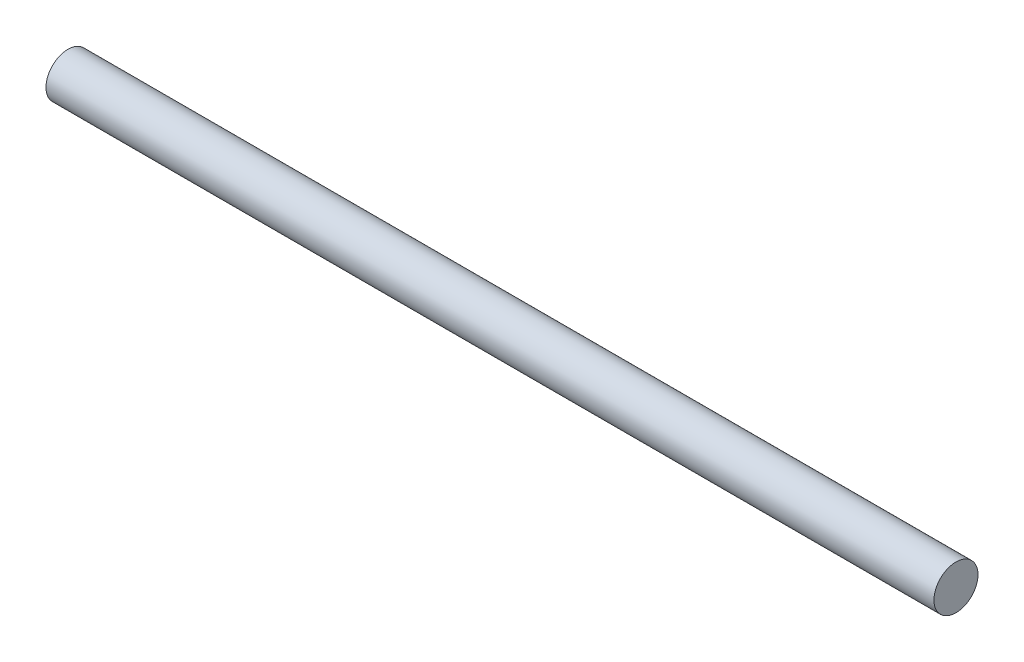
ISO-10303-21;
HEADER;
FILE_DESCRIPTION(('STEP AP214'),'2;1');
FILE_NAME('part.step','',(''),(''),'','','');
FILE_SCHEMA(('AUTOMOTIVE_DESIGN { 1 0 10303 214 1 1 1 1 }'));
ENDSEC;
DATA;
#1=APPLICATION_CONTEXT('core data for automotive mechanical design processes');
#2=APPLICATION_PROTOCOL_DEFINITION('international standard','automotive_design',2000,#1);
#3=PRODUCT_CONTEXT('',#1,'mechanical');
#4=PRODUCT('Part','Part','',(#3));
#5=PRODUCT_RELATED_PRODUCT_CATEGORY('part','',(#4));
#6=PRODUCT_DEFINITION_FORMATION('','',#4);
#7=PRODUCT_DEFINITION_CONTEXT('part definition',#1,'design');
#8=PRODUCT_DEFINITION('design','',#6,#7);
#9=PRODUCT_DEFINITION_SHAPE('','',#8);
#10=(LENGTH_UNIT() NAMED_UNIT(*) SI_UNIT(.MILLI.,.METRE.));
#11=(NAMED_UNIT(*) PLANE_ANGLE_UNIT() SI_UNIT($,.RADIAN.));
#12=(NAMED_UNIT(*) SI_UNIT($,.STERADIAN.) SOLID_ANGLE_UNIT());
#13=UNCERTAINTY_MEASURE_WITH_UNIT(LENGTH_MEASURE(1.E-05),#10,'distance_accuracy_value','');
#14=(GEOMETRIC_REPRESENTATION_CONTEXT(3) GLOBAL_UNCERTAINTY_ASSIGNED_CONTEXT((#13)) GLOBAL_UNIT_ASSIGNED_CONTEXT((#10,
#11,#12)) REPRESENTATION_CONTEXT('',''));
#15=CARTESIAN_POINT('',(0.,0.,0.));
#16=DIRECTION('',(0.,0.,1.));
#17=DIRECTION('',(1.,0.,0.));
#18=AXIS2_PLACEMENT_3D('',#15,#16,#17);
#19=CARTESIAN_POINT('',(32.,0.,0.));
#20=DIRECTION('',(-1.,0.,0.));
#21=DIRECTION('',(0.,0.,1.));
#22=AXIS2_PLACEMENT_3D('',#19,#20,#21);
#23=CYLINDRICAL_SURFACE('',#22,1.5875);
#24=CARTESIAN_POINT('',(32.,0.,0.));
#25=DIRECTION('',(1.,0.,0.));
#26=DIRECTION('',(0.,0.,-1.));
#27=AXIS2_PLACEMENT_3D('',#24,#25,#26);
#28=CIRCLE('',#27,1.5875);
#29=CARTESIAN_POINT('',(32.,0.,-1.5875));
#30=VERTEX_POINT('',#29);
#31=EDGE_CURVE('E10',#30,#30,#28,.T.);
#32=ORIENTED_EDGE('',*,*,#31,.F.);
#33=EDGE_LOOP('',(#32));
#34=FACE_BOUND('',#33,.T.);
#35=CARTESIAN_POINT('',(-32.,0.,0.));
#36=DIRECTION('',(1.,0.,0.));
#37=DIRECTION('',(0.,0.,-1.));
#38=AXIS2_PLACEMENT_3D('',#35,#36,#37);
#39=CIRCLE('',#38,1.5875);
#40=CARTESIAN_POINT('',(-32.,0.,-1.5875));
#41=VERTEX_POINT('',#40);
#42=EDGE_CURVE('E33',#41,#41,#39,.T.);
#43=ORIENTED_EDGE('',*,*,#42,.T.);
#44=EDGE_LOOP('',(#43));
#45=FACE_BOUND('',#44,.T.);
#46=ADVANCED_FACE('F30',(#34,#45),#23,.T.);
#47=CARTESIAN_POINT('',(32.,0.,0.));
#48=DIRECTION('',(1.,0.,0.));
#49=DIRECTION('',(0.,0.,-1.));
#50=AXIS2_PLACEMENT_3D('',#47,#48,#49);
#51=PLANE('',#50);
#52=ORIENTED_EDGE('',*,*,#31,.T.);
#53=EDGE_LOOP('',(#52));
#54=FACE_BOUND('',#53,.T.);
#55=ADVANCED_FACE('F45',(#54),#51,.T.);
#56=CARTESIAN_POINT('',(-32.,0.,0.));
#57=DIRECTION('',(1.,0.,0.));
#58=DIRECTION('',(0.,0.,-1.));
#59=AXIS2_PLACEMENT_3D('',#56,#57,#58);
#60=PLANE('',#59);
#61=ORIENTED_EDGE('',*,*,#42,.F.);
#62=EDGE_LOOP('',(#61));
#63=FACE_BOUND('',#62,.T.);
#64=ADVANCED_FACE('F43',(#63),#60,.F.);
#65=CLOSED_SHELL('',(#46,#55,#64));
#66=MANIFOLD_SOLID_BREP('B2',#65);
#67=ADVANCED_BREP_SHAPE_REPRESENTATION('',(#18,#66),#14);
#68=SHAPE_DEFINITION_REPRESENTATION(#9,#67);
ENDSEC;
END-ISO-10303-21;
